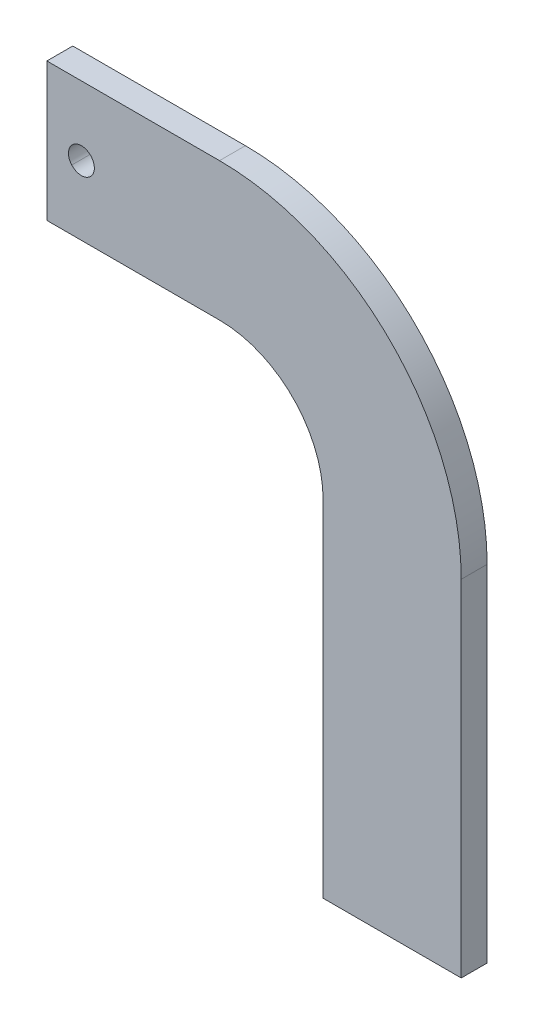
ISO-10303-21;
HEADER;
FILE_DESCRIPTION(('STEP AP214'),'2;1');
FILE_NAME('part.step','',(''),(''),'','','');
FILE_SCHEMA(('AUTOMOTIVE_DESIGN { 1 0 10303 214 1 1 1 1 }'));
ENDSEC;
DATA;
#1=APPLICATION_CONTEXT('core data for automotive mechanical design processes');
#2=APPLICATION_PROTOCOL_DEFINITION('international standard','automotive_design',2000,#1);
#3=PRODUCT_CONTEXT('',#1,'mechanical');
#4=PRODUCT('Part','Part','',(#3));
#5=PRODUCT_RELATED_PRODUCT_CATEGORY('part','',(#4));
#6=PRODUCT_DEFINITION_FORMATION('','',#4);
#7=PRODUCT_DEFINITION_CONTEXT('part definition',#1,'design');
#8=PRODUCT_DEFINITION('design','',#6,#7);
#9=PRODUCT_DEFINITION_SHAPE('','',#8);
#10=(LENGTH_UNIT() NAMED_UNIT(*) SI_UNIT(.MILLI.,.METRE.));
#11=(NAMED_UNIT(*) PLANE_ANGLE_UNIT() SI_UNIT($,.RADIAN.));
#12=(NAMED_UNIT(*) SI_UNIT($,.STERADIAN.) SOLID_ANGLE_UNIT());
#13=UNCERTAINTY_MEASURE_WITH_UNIT(LENGTH_MEASURE(1.E-05),#10,'distance_accuracy_value','');
#14=(GEOMETRIC_REPRESENTATION_CONTEXT(3) GLOBAL_UNCERTAINTY_ASSIGNED_CONTEXT((#13)) GLOBAL_UNIT_ASSIGNED_CONTEXT((#10,
#11,#12)) REPRESENTATION_CONTEXT('',''));
#15=CARTESIAN_POINT('',(0.,0.,0.));
#16=DIRECTION('',(0.,0.,1.));
#17=DIRECTION('',(1.,0.,0.));
#18=AXIS2_PLACEMENT_3D('',#15,#16,#17);
#19=CARTESIAN_POINT('',(-177.8,381.,19.05));
#20=DIRECTION('',(0.,0.,-1.));
#21=DIRECTION('',(-1.,0.,0.));
#22=AXIS2_PLACEMENT_3D('',#19,#20,#21);
#23=CYLINDRICAL_SURFACE('',#22,9.52499999999999);
#24=CARTESIAN_POINT('',(-177.8,381.,0.));
#25=DIRECTION('',(0.,0.,1.));
#26=DIRECTION('',(1.,0.,0.));
#27=AXIS2_PLACEMENT_3D('',#24,#25,#26);
#28=CIRCLE('',#27,9.52499999999999);
#29=CARTESIAN_POINT('',(-184.899515828562,374.65,0.));
#30=VERTEX_POINT('',#29);
#31=CARTESIAN_POINT('',(-170.700484171438,374.65,0.));
#32=VERTEX_POINT('',#31);
#33=EDGE_CURVE('E190',#30,#32,#28,.T.);
#34=ORIENTED_EDGE('',*,*,#33,.F.);
#35=DIRECTION('',(0.,0.,1.));
#36=VECTOR('',#35,1.);
#37=CARTESIAN_POINT('',(-184.899515828562,374.65,19.05));
#38=LINE('',#37,#36);
#39=CARTESIAN_POINT('',(-184.899515828562,374.65,19.05));
#40=VERTEX_POINT('',#39);
#41=EDGE_CURVE('E12',#30,#40,#38,.T.);
#42=ORIENTED_EDGE('',*,*,#41,.T.);
#43=CARTESIAN_POINT('',(-177.8,381.,19.05));
#44=DIRECTION('',(0.,0.,1.));
#45=DIRECTION('',(1.,0.,0.));
#46=AXIS2_PLACEMENT_3D('',#43,#44,#45);
#47=CIRCLE('',#46,9.52499999999999);
#48=CARTESIAN_POINT('',(-170.700484171438,374.65,19.05));
#49=VERTEX_POINT('',#48);
#50=EDGE_CURVE('E189',#40,#49,#47,.T.);
#51=ORIENTED_EDGE('',*,*,#50,.T.);
#52=DIRECTION('',(0.,0.,-1.));
#53=VECTOR('',#52,1.);
#54=CARTESIAN_POINT('',(-170.700484171438,374.65,19.05));
#55=LINE('',#54,#53);
#56=EDGE_CURVE('E49',#49,#32,#55,.T.);
#57=ORIENTED_EDGE('',*,*,#56,.T.);
#58=EDGE_LOOP('',(#34,#42,#51,#57));
#59=FACE_BOUND('',#58,.T.);
#60=ADVANCED_FACE('F41',(#59),#23,.F.);
#61=CARTESIAN_POINT('',(-76.2,254.,19.05));
#62=DIRECTION('',(0.,0.,1.));
#63=DIRECTION('',(1.,0.,0.));
#64=AXIS2_PLACEMENT_3D('',#61,#62,#63);
#65=PLANE('',#64);
#66=DIRECTION('',(0.,-1.,0.));
#67=VECTOR('',#66,1.);
#68=CARTESIAN_POINT('',(0.,0.,19.05));
#69=LINE('',#68,#67);
#70=CARTESIAN_POINT('',(0.,254.,19.05));
#71=VERTEX_POINT('',#70);
#72=CARTESIAN_POINT('',(0.,0.,19.05));
#73=VERTEX_POINT('',#72);
#74=EDGE_CURVE('E126',#71,#73,#69,.T.);
#75=ORIENTED_EDGE('',*,*,#74,.T.);
#76=DIRECTION('',(1.,0.,0.));
#77=VECTOR('',#76,1.);
#78=CARTESIAN_POINT('',(0.,0.,19.05));
#79=LINE('',#78,#77);
#80=CARTESIAN_POINT('',(101.6,0.,19.05));
#81=VERTEX_POINT('',#80);
#82=EDGE_CURVE('E115',#73,#81,#79,.T.);
#83=ORIENTED_EDGE('',*,*,#82,.T.);
#84=DIRECTION('',(0.,1.,0.));
#85=VECTOR('',#84,1.);
#86=CARTESIAN_POINT('',(101.6,0.,19.05));
#87=LINE('',#86,#85);
#88=CARTESIAN_POINT('',(101.6,254.,19.05));
#89=VERTEX_POINT('',#88);
#90=EDGE_CURVE('E125',#81,#89,#87,.T.);
#91=ORIENTED_EDGE('',*,*,#90,.T.);
#92=CARTESIAN_POINT('',(-76.2,254.,19.05));
#93=DIRECTION('',(0.,0.,1.));
#94=DIRECTION('',(1.,0.,0.));
#95=AXIS2_PLACEMENT_3D('',#92,#93,#94);
#96=CIRCLE('',#95,177.8);
#97=CARTESIAN_POINT('',(-76.2000000000003,431.8,19.05));
#98=VERTEX_POINT('',#97);
#99=EDGE_CURVE('E183',#89,#98,#96,.T.);
#100=ORIENTED_EDGE('',*,*,#99,.T.);
#101=DIRECTION('',(-1.,0.,0.));
#102=VECTOR('',#101,1.);
#103=CARTESIAN_POINT('',(-203.2,431.8,19.05));
#104=LINE('',#103,#102);
#105=CARTESIAN_POINT('',(-203.2,431.8,19.05));
#106=VERTEX_POINT('',#105);
#107=EDGE_CURVE('E181',#98,#106,#104,.T.);
#108=ORIENTED_EDGE('',*,*,#107,.T.);
#109=DIRECTION('',(0.,-1.,0.));
#110=VECTOR('',#109,1.);
#111=CARTESIAN_POINT('',(-203.2,330.2,19.05));
#112=LINE('',#111,#110);
#113=CARTESIAN_POINT('',(-203.2,330.2,19.05));
#114=VERTEX_POINT('',#113);
#115=EDGE_CURVE('E179',#106,#114,#112,.T.);
#116=ORIENTED_EDGE('',*,*,#115,.T.);
#117=DIRECTION('',(1.,0.,0.));
#118=VECTOR('',#117,1.);
#119=CARTESIAN_POINT('',(-76.2,330.2,19.05));
#120=LINE('',#119,#118);
#121=CARTESIAN_POINT('',(-76.2,330.2,19.05));
#122=VERTEX_POINT('',#121);
#123=EDGE_CURVE('E177',#114,#122,#120,.T.);
#124=ORIENTED_EDGE('',*,*,#123,.T.);
#125=CARTESIAN_POINT('',(-76.2,254.,19.05));
#126=DIRECTION('',(0.,0.,-1.));
#127=DIRECTION('',(1.,0.,0.));
#128=AXIS2_PLACEMENT_3D('',#125,#126,#127);
#129=CIRCLE('',#128,76.2);
#130=EDGE_CURVE('E132',#122,#71,#129,.T.);
#131=ORIENTED_EDGE('',*,*,#130,.T.);
#132=EDGE_LOOP('',(#75,#83,#91,#100,#108,#116,#124,#131));
#133=FACE_BOUND('',#132,.T.);
#134=EDGE_CURVE('E175',#49,#40,#47,.T.);
#135=ORIENTED_EDGE('',*,*,#134,.F.);
#136=ORIENTED_EDGE('',*,*,#50,.F.);
#137=EDGE_LOOP('',(#135,#136));
#138=FACE_BOUND('',#137,.T.);
#139=ADVANCED_FACE('F129',(#133,#138),#65,.T.);
#140=CARTESIAN_POINT('',(-76.2,254.,0.));
#141=DIRECTION('',(0.,0.,1.));
#142=DIRECTION('',(1.,0.,0.));
#143=AXIS2_PLACEMENT_3D('',#140,#141,#142);
#144=PLANE('',#143);
#145=DIRECTION('',(0.,-1.,0.));
#146=VECTOR('',#145,1.);
#147=CARTESIAN_POINT('',(0.,0.,0.));
#148=LINE('',#147,#146);
#149=CARTESIAN_POINT('',(0.,254.,0.));
#150=VERTEX_POINT('',#149);
#151=CARTESIAN_POINT('',(0.,0.,0.));
#152=VERTEX_POINT('',#151);
#153=EDGE_CURVE('E139',#150,#152,#148,.T.);
#154=ORIENTED_EDGE('',*,*,#153,.F.);
#155=CARTESIAN_POINT('',(-76.2,254.,0.));
#156=DIRECTION('',(0.,0.,-1.));
#157=DIRECTION('',(1.,0.,0.));
#158=AXIS2_PLACEMENT_3D('',#155,#156,#157);
#159=CIRCLE('',#158,76.2);
#160=CARTESIAN_POINT('',(-76.2,330.2,0.));
#161=VERTEX_POINT('',#160);
#162=EDGE_CURVE('E136',#161,#150,#159,.T.);
#163=ORIENTED_EDGE('',*,*,#162,.F.);
#164=DIRECTION('',(1.,0.,0.));
#165=VECTOR('',#164,1.);
#166=CARTESIAN_POINT('',(-76.2,330.2,0.));
#167=LINE('',#166,#165);
#168=CARTESIAN_POINT('',(-203.2,330.2,0.));
#169=VERTEX_POINT('',#168);
#170=EDGE_CURVE('E162',#169,#161,#167,.T.);
#171=ORIENTED_EDGE('',*,*,#170,.F.);
#172=DIRECTION('',(0.,-1.,0.));
#173=VECTOR('',#172,1.);
#174=CARTESIAN_POINT('',(-203.2,330.2,0.));
#175=LINE('',#174,#173);
#176=CARTESIAN_POINT('',(-203.2,431.8,0.));
#177=VERTEX_POINT('',#176);
#178=EDGE_CURVE('E164',#177,#169,#175,.T.);
#179=ORIENTED_EDGE('',*,*,#178,.F.);
#180=DIRECTION('',(-1.,0.,0.));
#181=VECTOR('',#180,1.);
#182=CARTESIAN_POINT('',(-203.2,431.8,0.));
#183=LINE('',#182,#181);
#184=CARTESIAN_POINT('',(-76.2000000000003,431.8,0.));
#185=VERTEX_POINT('',#184);
#186=EDGE_CURVE('E166',#185,#177,#183,.T.);
#187=ORIENTED_EDGE('',*,*,#186,.F.);
#188=CARTESIAN_POINT('',(-76.2,254.,0.));
#189=DIRECTION('',(0.,0.,1.));
#190=DIRECTION('',(1.,0.,0.));
#191=AXIS2_PLACEMENT_3D('',#188,#189,#190);
#192=CIRCLE('',#191,177.8);
#193=CARTESIAN_POINT('',(101.6,254.,0.));
#194=VERTEX_POINT('',#193);
#195=EDGE_CURVE('E168',#194,#185,#192,.T.);
#196=ORIENTED_EDGE('',*,*,#195,.F.);
#197=DIRECTION('',(0.,1.,0.));
#198=VECTOR('',#197,1.);
#199=CARTESIAN_POINT('',(101.6,0.,0.));
#200=LINE('',#199,#198);
#201=CARTESIAN_POINT('',(101.6,0.,0.));
#202=VERTEX_POINT('',#201);
#203=EDGE_CURVE('E170',#202,#194,#200,.T.);
#204=ORIENTED_EDGE('',*,*,#203,.F.);
#205=DIRECTION('',(1.,0.,0.));
#206=VECTOR('',#205,1.);
#207=CARTESIAN_POINT('',(0.,0.,0.));
#208=LINE('',#207,#206);
#209=EDGE_CURVE('E172',#152,#202,#208,.T.);
#210=ORIENTED_EDGE('',*,*,#209,.F.);
#211=EDGE_LOOP('',(#154,#163,#171,#179,#187,#196,#204,#210));
#212=FACE_BOUND('',#211,.T.);
#213=EDGE_CURVE('E186',#32,#30,#28,.T.);
#214=ORIENTED_EDGE('',*,*,#213,.T.);
#215=ORIENTED_EDGE('',*,*,#33,.T.);
#216=EDGE_LOOP('',(#214,#215));
#217=FACE_BOUND('',#216,.T.);
#218=ADVANCED_FACE('F195',(#212,#217),#144,.F.);
#219=CARTESIAN_POINT('',(0.,0.,19.05));
#220=DIRECTION('',(1.,0.,0.));
#221=DIRECTION('',(0.,0.,-1.));
#222=AXIS2_PLACEMENT_3D('',#219,#220,#221);
#223=PLANE('',#222);
#224=ORIENTED_EDGE('',*,*,#153,.T.);
#225=DIRECTION('',(0.,0.,-1.));
#226=VECTOR('',#225,1.);
#227=CARTESIAN_POINT('',(0.,0.,19.05));
#228=LINE('',#227,#226);
#229=EDGE_CURVE('E119',#73,#152,#228,.T.);
#230=ORIENTED_EDGE('',*,*,#229,.F.);
#231=ORIENTED_EDGE('',*,*,#74,.F.);
#232=DIRECTION('',(0.,0.,-1.));
#233=VECTOR('',#232,1.);
#234=CARTESIAN_POINT('',(0.,254.,19.05));
#235=LINE('',#234,#233);
#236=EDGE_CURVE('E159',#71,#150,#235,.T.);
#237=ORIENTED_EDGE('',*,*,#236,.T.);
#238=EDGE_LOOP('',(#224,#230,#231,#237));
#239=FACE_BOUND('',#238,.T.);
#240=ADVANCED_FACE('F43',(#239),#223,.F.);
#241=CARTESIAN_POINT('',(0.,0.,19.05));
#242=DIRECTION('',(0.,1.,0.));
#243=DIRECTION('',(0.,0.,1.));
#244=AXIS2_PLACEMENT_3D('',#241,#242,#243);
#245=PLANE('',#244);
#246=ORIENTED_EDGE('',*,*,#209,.T.);
#247=DIRECTION('',(0.,0.,-1.));
#248=VECTOR('',#247,1.);
#249=CARTESIAN_POINT('',(101.6,0.,19.05));
#250=LINE('',#249,#248);
#251=EDGE_CURVE('E122',#81,#202,#250,.T.);
#252=ORIENTED_EDGE('',*,*,#251,.F.);
#253=ORIENTED_EDGE('',*,*,#82,.F.);
#254=ORIENTED_EDGE('',*,*,#229,.T.);
#255=EDGE_LOOP('',(#246,#252,#253,#254));
#256=FACE_BOUND('',#255,.T.);
#257=ADVANCED_FACE('F117',(#256),#245,.F.);
#258=CARTESIAN_POINT('',(101.6,0.,19.05));
#259=DIRECTION('',(-1.,0.,0.));
#260=DIRECTION('',(0.,0.,1.));
#261=AXIS2_PLACEMENT_3D('',#258,#259,#260);
#262=PLANE('',#261);
#263=ORIENTED_EDGE('',*,*,#203,.T.);
#264=DIRECTION('',(0.,0.,-1.));
#265=VECTOR('',#264,1.);
#266=CARTESIAN_POINT('',(101.6,254.,19.05));
#267=LINE('',#266,#265);
#268=EDGE_CURVE('E142',#89,#194,#267,.T.);
#269=ORIENTED_EDGE('',*,*,#268,.F.);
#270=ORIENTED_EDGE('',*,*,#90,.F.);
#271=ORIENTED_EDGE('',*,*,#251,.T.);
#272=EDGE_LOOP('',(#263,#269,#270,#271));
#273=FACE_BOUND('',#272,.T.);
#274=ADVANCED_FACE('F224',(#273),#262,.F.);
#275=CARTESIAN_POINT('',(-76.2,254.,19.05));
#276=DIRECTION('',(0.,0.,-1.));
#277=DIRECTION('',(-1.,0.,0.));
#278=AXIS2_PLACEMENT_3D('',#275,#276,#277);
#279=CYLINDRICAL_SURFACE('',#278,177.8);
#280=ORIENTED_EDGE('',*,*,#195,.T.);
#281=DIRECTION('',(0.,0.,-1.));
#282=VECTOR('',#281,1.);
#283=CARTESIAN_POINT('',(-76.2000000000003,431.8,19.05));
#284=LINE('',#283,#282);
#285=EDGE_CURVE('E147',#98,#185,#284,.T.);
#286=ORIENTED_EDGE('',*,*,#285,.F.);
#287=ORIENTED_EDGE('',*,*,#99,.F.);
#288=ORIENTED_EDGE('',*,*,#268,.T.);
#289=EDGE_LOOP('',(#280,#286,#287,#288));
#290=FACE_BOUND('',#289,.T.);
#291=ADVANCED_FACE('F220',(#290),#279,.T.);
#292=CARTESIAN_POINT('',(-203.2,431.8,19.05));
#293=DIRECTION('',(0.,-1.,0.));
#294=DIRECTION('',(0.,0.,-1.));
#295=AXIS2_PLACEMENT_3D('',#292,#293,#294);
#296=PLANE('',#295);
#297=ORIENTED_EDGE('',*,*,#186,.T.);
#298=DIRECTION('',(0.,0.,-1.));
#299=VECTOR('',#298,1.);
#300=CARTESIAN_POINT('',(-203.2,431.8,19.05));
#301=LINE('',#300,#299);
#302=EDGE_CURVE('E150',#106,#177,#301,.T.);
#303=ORIENTED_EDGE('',*,*,#302,.F.);
#304=ORIENTED_EDGE('',*,*,#107,.F.);
#305=ORIENTED_EDGE('',*,*,#285,.T.);
#306=EDGE_LOOP('',(#297,#303,#304,#305));
#307=FACE_BOUND('',#306,.T.);
#308=ADVANCED_FACE('F216',(#307),#296,.F.);
#309=CARTESIAN_POINT('',(-203.2,330.2,19.05));
#310=DIRECTION('',(1.,0.,0.));
#311=DIRECTION('',(0.,0.,-1.));
#312=AXIS2_PLACEMENT_3D('',#309,#310,#311);
#313=PLANE('',#312);
#314=ORIENTED_EDGE('',*,*,#178,.T.);
#315=DIRECTION('',(0.,0.,-1.));
#316=VECTOR('',#315,1.);
#317=CARTESIAN_POINT('',(-203.2,330.2,19.05));
#318=LINE('',#317,#316);
#319=EDGE_CURVE('E153',#114,#169,#318,.T.);
#320=ORIENTED_EDGE('',*,*,#319,.F.);
#321=ORIENTED_EDGE('',*,*,#115,.F.);
#322=ORIENTED_EDGE('',*,*,#302,.T.);
#323=EDGE_LOOP('',(#314,#320,#321,#322));
#324=FACE_BOUND('',#323,.T.);
#325=ADVANCED_FACE('F212',(#324),#313,.F.);
#326=CARTESIAN_POINT('',(-76.2,330.2,19.05));
#327=DIRECTION('',(0.,1.,0.));
#328=DIRECTION('',(-1.,0.,0.));
#329=AXIS2_PLACEMENT_3D('',#326,#327,#328);
#330=PLANE('',#329);
#331=ORIENTED_EDGE('',*,*,#170,.T.);
#332=DIRECTION('',(0.,0.,-1.));
#333=VECTOR('',#332,1.);
#334=CARTESIAN_POINT('',(-76.2,330.2,19.05));
#335=LINE('',#334,#333);
#336=EDGE_CURVE('E156',#122,#161,#335,.T.);
#337=ORIENTED_EDGE('',*,*,#336,.F.);
#338=ORIENTED_EDGE('',*,*,#123,.F.);
#339=ORIENTED_EDGE('',*,*,#319,.T.);
#340=EDGE_LOOP('',(#331,#337,#338,#339));
#341=FACE_BOUND('',#340,.T.);
#342=ADVANCED_FACE('F208',(#341),#330,.F.);
#343=CARTESIAN_POINT('',(-76.2,254.,19.05));
#344=DIRECTION('',(0.,0.,-1.));
#345=DIRECTION('',(-1.,0.,0.));
#346=AXIS2_PLACEMENT_3D('',#343,#344,#345);
#347=CYLINDRICAL_SURFACE('',#346,76.2);
#348=ORIENTED_EDGE('',*,*,#162,.T.);
#349=ORIENTED_EDGE('',*,*,#236,.F.);
#350=ORIENTED_EDGE('',*,*,#130,.F.);
#351=ORIENTED_EDGE('',*,*,#336,.T.);
#352=EDGE_LOOP('',(#348,#349,#350,#351));
#353=FACE_BOUND('',#352,.T.);
#354=ADVANCED_FACE('F205',(#353),#347,.F.);
#355=ORIENTED_EDGE('',*,*,#41,.F.);
#356=ORIENTED_EDGE('',*,*,#213,.F.);
#357=ORIENTED_EDGE('',*,*,#56,.F.);
#358=ORIENTED_EDGE('',*,*,#134,.T.);
#359=EDGE_LOOP('',(#355,#356,#357,#358));
#360=FACE_BOUND('',#359,.T.);
#361=ADVANCED_FACE('F193',(#360),#23,.F.);
#362=CLOSED_SHELL('',(#60,#139,#218,#240,#257,#274,#291,#308,#325,#342,#354,#361));
#363=MANIFOLD_SOLID_BREP('B2',#362);
#364=ADVANCED_BREP_SHAPE_REPRESENTATION('',(#18,#363),#14);
#365=SHAPE_DEFINITION_REPRESENTATION(#9,#364);
ENDSEC;
END-ISO-10303-21;
